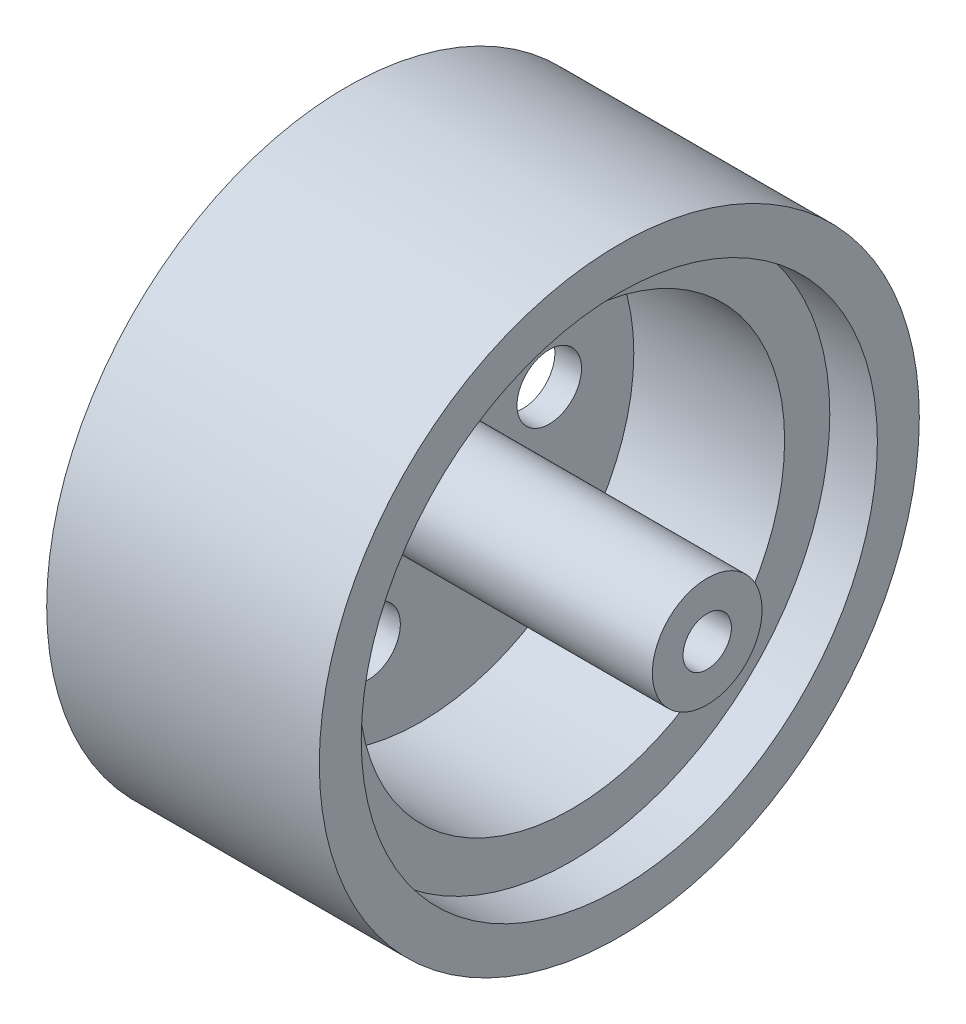
ISO-10303-21;
HEADER;
FILE_DESCRIPTION(('STEP AP214'),'2;1');
FILE_NAME('part.step','',(''),(''),'','','');
FILE_SCHEMA(('AUTOMOTIVE_DESIGN { 1 0 10303 214 1 1 1 1 }'));
ENDSEC;
DATA;
#1=APPLICATION_CONTEXT('core data for automotive mechanical design processes');
#2=APPLICATION_PROTOCOL_DEFINITION('international standard','automotive_design',2000,#1);
#3=PRODUCT_CONTEXT('',#1,'mechanical');
#4=PRODUCT('Part','Part','',(#3));
#5=PRODUCT_RELATED_PRODUCT_CATEGORY('part','',(#4));
#6=PRODUCT_DEFINITION_FORMATION('','',#4);
#7=PRODUCT_DEFINITION_CONTEXT('part definition',#1,'design');
#8=PRODUCT_DEFINITION('design','',#6,#7);
#9=PRODUCT_DEFINITION_SHAPE('','',#8);
#10=(LENGTH_UNIT() NAMED_UNIT(*) SI_UNIT(.MILLI.,.METRE.));
#11=(NAMED_UNIT(*) PLANE_ANGLE_UNIT() SI_UNIT($,.RADIAN.));
#12=(NAMED_UNIT(*) SI_UNIT($,.STERADIAN.) SOLID_ANGLE_UNIT());
#13=UNCERTAINTY_MEASURE_WITH_UNIT(LENGTH_MEASURE(1.E-05),#10,'distance_accuracy_value','');
#14=(GEOMETRIC_REPRESENTATION_CONTEXT(3) GLOBAL_UNCERTAINTY_ASSIGNED_CONTEXT((#13)) GLOBAL_UNIT_ASSIGNED_CONTEXT((#10,
#11,#12)) REPRESENTATION_CONTEXT('',''));
#15=CARTESIAN_POINT('',(0.,0.,0.));
#16=DIRECTION('',(0.,0.,1.));
#17=DIRECTION('',(1.,0.,0.));
#18=AXIS2_PLACEMENT_3D('',#15,#16,#17);
#19=CARTESIAN_POINT('',(11.,0.,0.));
#20=DIRECTION('',(1.,0.,0.));
#21=DIRECTION('',(0.,0.,-1.));
#22=AXIS2_PLACEMENT_3D('',#19,#20,#21);
#23=PLANE('',#22);
#24=CARTESIAN_POINT('',(11.,0.,0.));
#25=DIRECTION('',(1.,0.,0.));
#26=DIRECTION('',(0.,0.,-1.));
#27=AXIS2_PLACEMENT_3D('',#24,#25,#26);
#28=CIRCLE('',#27,13.2);
#29=CARTESIAN_POINT('',(11.,0.,-13.2));
#30=VERTEX_POINT('',#29);
#31=EDGE_CURVE('E44',#30,#30,#28,.T.);
#32=ORIENTED_EDGE('',*,*,#31,.F.);
#33=EDGE_LOOP('',(#32));
#34=FACE_BOUND('',#33,.T.);
#35=CARTESIAN_POINT('',(11.,0.,0.));
#36=DIRECTION('',(1.,0.,0.));
#37=DIRECTION('',(0.,0.,-1.));
#38=AXIS2_PLACEMENT_3D('',#35,#36,#37);
#39=CIRCLE('',#38,16.);
#40=CARTESIAN_POINT('',(11.,0.,-16.));
#41=VERTEX_POINT('',#40);
#42=EDGE_CURVE('E127',#41,#41,#39,.F.);
#43=ORIENTED_EDGE('',*,*,#42,.F.);
#44=EDGE_LOOP('',(#43));
#45=FACE_BOUND('',#44,.T.);
#46=ADVANCED_FACE('F31',(#34,#45),#23,.T.);
#47=CARTESIAN_POINT('',(0.,0.,0.));
#48=DIRECTION('',(1.,0.,0.));
#49=DIRECTION('',(0.,0.,-1.));
#50=AXIS2_PLACEMENT_3D('',#47,#48,#49);
#51=PLANE('',#50);
#52=CARTESIAN_POINT('',(0.,0.,0.));
#53=DIRECTION('',(1.,0.,0.));
#54=DIRECTION('',(0.,0.,-1.));
#55=AXIS2_PLACEMENT_3D('',#52,#53,#54);
#56=CIRCLE('',#55,1.5);
#57=CARTESIAN_POINT('',(0.,0.,-1.5));
#58=VERTEX_POINT('',#57);
#59=EDGE_CURVE('E89',#58,#58,#56,.T.);
#60=ORIENTED_EDGE('',*,*,#59,.T.);
#61=EDGE_LOOP('',(#60));
#62=FACE_BOUND('',#61,.T.);
#63=CARTESIAN_POINT('',(0.,-7.29999835677502,3.27261729982013));
#64=DIRECTION('',(-1.,0.,0.));
#65=DIRECTION('',(0.,-0.866025403784436,-0.500000000000004));
#66=AXIS2_PLACEMENT_3D('',#63,#64,#65);
#67=CIRCLE('',#66,2.);
#68=CARTESIAN_POINT('',(0.,-9.0320491643439,2.27261729982012));
#69=VERTEX_POINT('',#68);
#70=EDGE_CURVE('E53',#69,#69,#67,.T.);
#71=ORIENTED_EDGE('',*,*,#70,.F.);
#72=EDGE_LOOP('',(#71));
#73=FACE_BOUND('',#72,.T.);
#74=CARTESIAN_POINT('',(0.,0.815829459878878,-7.95829267446189));
#75=DIRECTION('',(-1.,0.,0.));
#76=DIRECTION('',(0.,0.866025403784443,-0.499999999999992));
#77=AXIS2_PLACEMENT_3D('',#74,#75,#76);
#78=CIRCLE('',#77,2.);
#79=CARTESIAN_POINT('',(0.,2.54788026744776,-8.95829267446187));
#80=VERTEX_POINT('',#79);
#81=EDGE_CURVE('E58',#80,#80,#78,.T.);
#82=ORIENTED_EDGE('',*,*,#81,.F.);
#83=EDGE_LOOP('',(#82));
#84=FACE_BOUND('',#83,.T.);
#85=CARTESIAN_POINT('',(0.,6.4841688968962,4.68567537464173));
#86=DIRECTION('',(-1.,0.,0.));
#87=DIRECTION('',(0.,0.,1.));
#88=AXIS2_PLACEMENT_3D('',#85,#86,#87);
#89=CIRCLE('',#88,2.);
#90=CARTESIAN_POINT('',(0.,6.4841688968962,6.68567537464173));
#91=VERTEX_POINT('',#90);
#92=EDGE_CURVE('E50',#91,#91,#89,.T.);
#93=ORIENTED_EDGE('',*,*,#92,.F.);
#94=EDGE_LOOP('',(#93));
#95=FACE_BOUND('',#94,.T.);
#96=CARTESIAN_POINT('',(0.,0.,0.));
#97=DIRECTION('',(1.,0.,0.));
#98=DIRECTION('',(0.,0.,-1.));
#99=AXIS2_PLACEMENT_3D('',#96,#97,#98);
#100=CIRCLE('',#99,16.);
#101=CARTESIAN_POINT('',(0.,0.,-16.));
#102=VERTEX_POINT('',#101);
#103=EDGE_CURVE('E10',#102,#102,#100,.T.);
#104=ORIENTED_EDGE('',*,*,#103,.F.);
#105=EDGE_LOOP('',(#104));
#106=FACE_BOUND('',#105,.T.);
#107=ADVANCED_FACE('F33',(#62,#73,#84,#95,#106),#51,.F.);
#108=CARTESIAN_POINT('',(1.65,0.,0.));
#109=DIRECTION('',(1.,0.,0.));
#110=DIRECTION('',(0.,0.,-1.));
#111=AXIS2_PLACEMENT_3D('',#108,#109,#110);
#112=CYLINDRICAL_SURFACE('',#111,13.2);
#113=CARTESIAN_POINT('',(1.65,0.,0.));
#114=DIRECTION('',(1.,0.,0.));
#115=DIRECTION('',(0.,0.,-1.));
#116=AXIS2_PLACEMENT_3D('',#113,#114,#115);
#117=CIRCLE('',#116,13.2);
#118=CARTESIAN_POINT('',(1.65,0.,-13.2));
#119=VERTEX_POINT('',#118);
#120=EDGE_CURVE('E39',#119,#119,#117,.T.);
#121=ORIENTED_EDGE('',*,*,#120,.F.);
#122=EDGE_LOOP('',(#121));
#123=FACE_BOUND('',#122,.T.);
#124=ORIENTED_EDGE('',*,*,#31,.T.);
#125=EDGE_LOOP('',(#124));
#126=FACE_BOUND('',#125,.T.);
#127=ADVANCED_FACE('F76',(#123,#126),#112,.F.);
#128=CARTESIAN_POINT('',(1.65,0.,0.));
#129=DIRECTION('',(1.,0.,0.));
#130=DIRECTION('',(0.,0.,-1.));
#131=AXIS2_PLACEMENT_3D('',#128,#129,#130);
#132=PLANE('',#131);
#133=CARTESIAN_POINT('',(1.65,0.,0.));
#134=DIRECTION('',(1.,0.,0.));
#135=DIRECTION('',(0.,0.,-1.));
#136=AXIS2_PLACEMENT_3D('',#133,#134,#135);
#137=CIRCLE('',#136,3.4);
#138=CARTESIAN_POINT('',(1.65,0.,-3.4));
#139=VERTEX_POINT('',#138);
#140=EDGE_CURVE('E66',#139,#139,#137,.T.);
#141=ORIENTED_EDGE('',*,*,#140,.F.);
#142=EDGE_LOOP('',(#141));
#143=FACE_BOUND('',#142,.T.);
#144=CARTESIAN_POINT('',(1.65,-7.29999835677502,3.27261729982013));
#145=DIRECTION('',(1.,0.,0.));
#146=DIRECTION('',(0.,0.,-1.));
#147=AXIS2_PLACEMENT_3D('',#144,#145,#146);
#148=CIRCLE('',#147,2.);
#149=CARTESIAN_POINT('',(1.65,-7.29999835677502,1.27261729982013));
#150=VERTEX_POINT('',#149);
#151=EDGE_CURVE('E35',#150,#150,#148,.T.);
#152=ORIENTED_EDGE('',*,*,#151,.F.);
#153=EDGE_LOOP('',(#152));
#154=FACE_BOUND('',#153,.T.);
#155=CARTESIAN_POINT('',(1.65,0.815829459878878,-7.95829267446189));
#156=DIRECTION('',(1.,0.,0.));
#157=DIRECTION('',(0.,0.,-1.));
#158=AXIS2_PLACEMENT_3D('',#155,#156,#157);
#159=CIRCLE('',#158,2.);
#160=CARTESIAN_POINT('',(1.65,0.815829459878878,-9.95829267446189));
#161=VERTEX_POINT('',#160);
#162=EDGE_CURVE('E51',#161,#161,#159,.T.);
#163=ORIENTED_EDGE('',*,*,#162,.F.);
#164=EDGE_LOOP('',(#163));
#165=FACE_BOUND('',#164,.T.);
#166=CARTESIAN_POINT('',(1.65,6.4841688968962,4.68567537464173));
#167=DIRECTION('',(1.,0.,0.));
#168=DIRECTION('',(0.,0.,-1.));
#169=AXIS2_PLACEMENT_3D('',#166,#167,#168);
#170=CIRCLE('',#169,2.);
#171=CARTESIAN_POINT('',(1.65,6.4841688968962,2.68567537464173));
#172=VERTEX_POINT('',#171);
#173=EDGE_CURVE('E48',#172,#172,#170,.T.);
#174=ORIENTED_EDGE('',*,*,#173,.F.);
#175=EDGE_LOOP('',(#174));
#176=FACE_BOUND('',#175,.T.);
#177=ORIENTED_EDGE('',*,*,#120,.T.);
#178=EDGE_LOOP('',(#177));
#179=FACE_BOUND('',#178,.T.);
#180=ADVANCED_FACE('F82',(#143,#154,#165,#176,#179),#132,.T.);
#181=CARTESIAN_POINT('',(9.35,6.4841688968962,4.68567537464173));
#182=DIRECTION('',(-1.,0.,0.));
#183=DIRECTION('',(0.,0.,1.));
#184=AXIS2_PLACEMENT_3D('',#181,#182,#183);
#185=CYLINDRICAL_SURFACE('',#184,2.);
#186=ORIENTED_EDGE('',*,*,#173,.T.);
#187=EDGE_LOOP('',(#186));
#188=FACE_BOUND('',#187,.T.);
#189=ORIENTED_EDGE('',*,*,#92,.T.);
#190=EDGE_LOOP('',(#189));
#191=FACE_BOUND('',#190,.T.);
#192=ADVANCED_FACE('F72',(#188,#191),#185,.F.);
#193=CARTESIAN_POINT('',(9.35,0.815829459878878,-7.95829267446189));
#194=DIRECTION('',(-1.,0.,0.));
#195=DIRECTION('',(0.,0.,1.));
#196=AXIS2_PLACEMENT_3D('',#193,#194,#195);
#197=CYLINDRICAL_SURFACE('',#196,2.);
#198=ORIENTED_EDGE('',*,*,#162,.T.);
#199=EDGE_LOOP('',(#198));
#200=FACE_BOUND('',#199,.T.);
#201=ORIENTED_EDGE('',*,*,#81,.T.);
#202=EDGE_LOOP('',(#201));
#203=FACE_BOUND('',#202,.T.);
#204=ADVANCED_FACE('F93',(#200,#203),#197,.F.);
#205=CARTESIAN_POINT('',(9.35,-7.29999835677502,3.27261729982013));
#206=DIRECTION('',(-1.,0.,0.));
#207=DIRECTION('',(0.,0.,1.));
#208=AXIS2_PLACEMENT_3D('',#205,#206,#207);
#209=CYLINDRICAL_SURFACE('',#208,2.);
#210=ORIENTED_EDGE('',*,*,#151,.T.);
#211=EDGE_LOOP('',(#210));
#212=FACE_BOUND('',#211,.T.);
#213=ORIENTED_EDGE('',*,*,#70,.T.);
#214=EDGE_LOOP('',(#213));
#215=FACE_BOUND('',#214,.T.);
#216=ADVANCED_FACE('F95',(#212,#215),#209,.F.);
#217=CARTESIAN_POINT('',(19.4,0.,0.));
#218=DIRECTION('',(-1.,0.,0.));
#219=DIRECTION('',(0.,0.,1.));
#220=AXIS2_PLACEMENT_3D('',#217,#218,#219);
#221=CYLINDRICAL_SURFACE('',#220,3.4);
#222=CARTESIAN_POINT('',(19.4,0.,0.));
#223=DIRECTION('',(1.,0.,0.));
#224=DIRECTION('',(0.,0.,-1.));
#225=AXIS2_PLACEMENT_3D('',#222,#223,#224);
#226=CIRCLE('',#225,3.4);
#227=CARTESIAN_POINT('',(19.4,0.,-3.4));
#228=VERTEX_POINT('',#227);
#229=EDGE_CURVE('E63',#228,#228,#226,.T.);
#230=ORIENTED_EDGE('',*,*,#229,.F.);
#231=EDGE_LOOP('',(#230));
#232=FACE_BOUND('',#231,.T.);
#233=ORIENTED_EDGE('',*,*,#140,.T.);
#234=EDGE_LOOP('',(#233));
#235=FACE_BOUND('',#234,.T.);
#236=ADVANCED_FACE('F101',(#232,#235),#221,.T.);
#237=CARTESIAN_POINT('',(19.4,0.,0.));
#238=DIRECTION('',(1.,0.,0.));
#239=DIRECTION('',(0.,0.,-1.));
#240=AXIS2_PLACEMENT_3D('',#237,#238,#239);
#241=PLANE('',#240);
#242=CARTESIAN_POINT('',(19.4,0.,0.));
#243=DIRECTION('',(1.,0.,0.));
#244=DIRECTION('',(0.,0.,-1.));
#245=AXIS2_PLACEMENT_3D('',#242,#243,#244);
#246=CIRCLE('',#245,1.5);
#247=CARTESIAN_POINT('',(19.4,0.,-1.5));
#248=VERTEX_POINT('',#247);
#249=EDGE_CURVE('E129',#248,#248,#246,.T.);
#250=ORIENTED_EDGE('',*,*,#249,.F.);
#251=EDGE_LOOP('',(#250));
#252=FACE_BOUND('',#251,.T.);
#253=ORIENTED_EDGE('',*,*,#229,.T.);
#254=EDGE_LOOP('',(#253));
#255=FACE_BOUND('',#254,.T.);
#256=ADVANCED_FACE('F144',(#252,#255),#241,.T.);
#257=CARTESIAN_POINT('',(-6.35,0.,0.));
#258=DIRECTION('',(1.,0.,0.));
#259=DIRECTION('',(0.,0.,-1.));
#260=AXIS2_PLACEMENT_3D('',#257,#258,#259);
#261=CYLINDRICAL_SURFACE('',#260,1.5);
#262=ORIENTED_EDGE('',*,*,#249,.T.);
#263=EDGE_LOOP('',(#262));
#264=FACE_BOUND('',#263,.T.);
#265=ORIENTED_EDGE('',*,*,#59,.F.);
#266=EDGE_LOOP('',(#265));
#267=FACE_BOUND('',#266,.T.);
#268=ADVANCED_FACE('F149',(#264,#267),#261,.F.);
#269=CARTESIAN_POINT('',(-2.95,0.,0.));
#270=DIRECTION('',(1.,0.,0.));
#271=DIRECTION('',(0.,0.,-1.));
#272=AXIS2_PLACEMENT_3D('',#269,#270,#271);
#273=CYLINDRICAL_SURFACE('',#272,16.);
#274=CARTESIAN_POINT('',(-2.95,0.,0.));
#275=DIRECTION('',(-1.,0.,0.));
#276=DIRECTION('',(0.,0.,1.));
#277=AXIS2_PLACEMENT_3D('',#274,#275,#276);
#278=CIRCLE('',#277,16.);
#279=CARTESIAN_POINT('',(-2.95,0.,16.));
#280=VERTEX_POINT('',#279);
#281=EDGE_CURVE('E135',#280,#280,#278,.T.);
#282=ORIENTED_EDGE('',*,*,#281,.T.);
#283=EDGE_LOOP('',(#282));
#284=FACE_BOUND('',#283,.T.);
#285=ORIENTED_EDGE('',*,*,#103,.T.);
#286=EDGE_LOOP('',(#285));
#287=FACE_BOUND('',#286,.T.);
#288=ADVANCED_FACE('F155',(#284,#287),#273,.F.);
#289=CARTESIAN_POINT('',(-2.95,0.,0.));
#290=DIRECTION('',(-1.,0.,0.));
#291=DIRECTION('',(0.,0.,1.));
#292=AXIS2_PLACEMENT_3D('',#289,#290,#291);
#293=PLANE('',#292);
#294=CARTESIAN_POINT('',(-2.95,0.,0.));
#295=DIRECTION('',(-1.,0.,0.));
#296=DIRECTION('',(0.,0.,1.));
#297=AXIS2_PLACEMENT_3D('',#294,#295,#296);
#298=CIRCLE('',#297,18.6);
#299=CARTESIAN_POINT('',(-2.95,0.,18.6));
#300=VERTEX_POINT('',#299);
#301=EDGE_CURVE('E130',#300,#300,#298,.T.);
#302=ORIENTED_EDGE('',*,*,#301,.T.);
#303=EDGE_LOOP('',(#302));
#304=FACE_BOUND('',#303,.T.);
#305=ORIENTED_EDGE('',*,*,#281,.F.);
#306=EDGE_LOOP('',(#305));
#307=FACE_BOUND('',#306,.T.);
#308=ADVANCED_FACE('F161',(#304,#307),#293,.T.);
#309=CARTESIAN_POINT('',(-2.95,0.,0.));
#310=DIRECTION('',(1.,0.,0.));
#311=DIRECTION('',(0.,0.,-1.));
#312=AXIS2_PLACEMENT_3D('',#309,#310,#311);
#313=CYLINDRICAL_SURFACE('',#312,18.6);
#314=ORIENTED_EDGE('',*,*,#301,.F.);
#315=EDGE_LOOP('',(#314));
#316=FACE_BOUND('',#315,.T.);
#317=CARTESIAN_POINT('',(13.95,0.,0.));
#318=DIRECTION('',(-1.,0.,0.));
#319=DIRECTION('',(0.,0.,1.));
#320=AXIS2_PLACEMENT_3D('',#317,#318,#319);
#321=CIRCLE('',#320,18.6);
#322=CARTESIAN_POINT('',(13.95,0.,18.6));
#323=VERTEX_POINT('',#322);
#324=EDGE_CURVE('E179',#323,#323,#321,.T.);
#325=ORIENTED_EDGE('',*,*,#324,.T.);
#326=EDGE_LOOP('',(#325));
#327=FACE_BOUND('',#326,.T.);
#328=ADVANCED_FACE('F157',(#316,#327),#313,.T.);
#329=ORIENTED_EDGE('',*,*,#42,.T.);
#330=EDGE_LOOP('',(#329));
#331=FACE_BOUND('',#330,.T.);
#332=CARTESIAN_POINT('',(13.95,0.,0.));
#333=DIRECTION('',(-1.,0.,0.));
#334=DIRECTION('',(0.,0.,1.));
#335=AXIS2_PLACEMENT_3D('',#332,#333,#334);
#336=CIRCLE('',#335,16.);
#337=CARTESIAN_POINT('',(13.95,0.,16.));
#338=VERTEX_POINT('',#337);
#339=EDGE_CURVE('E176',#338,#338,#336,.T.);
#340=ORIENTED_EDGE('',*,*,#339,.F.);
#341=EDGE_LOOP('',(#340));
#342=FACE_BOUND('',#341,.T.);
#343=ADVANCED_FACE('F160',(#331,#342),#273,.F.);
#344=CARTESIAN_POINT('',(13.95,0.,0.));
#345=DIRECTION('',(-1.,0.,0.));
#346=DIRECTION('',(0.,0.,1.));
#347=AXIS2_PLACEMENT_3D('',#344,#345,#346);
#348=PLANE('',#347);
#349=ORIENTED_EDGE('',*,*,#339,.T.);
#350=EDGE_LOOP('',(#349));
#351=FACE_BOUND('',#350,.T.);
#352=ORIENTED_EDGE('',*,*,#324,.F.);
#353=EDGE_LOOP('',(#352));
#354=FACE_BOUND('',#353,.T.);
#355=ADVANCED_FACE('F168',(#351,#354),#348,.F.);
#356=CLOSED_SHELL('',(#46,#107,#127,#180,#192,#204,#216,#236,#256,#268,#288,#308,#328,#343,#355));
#357=MANIFOLD_SOLID_BREP('B2',#356);
#358=ADVANCED_BREP_SHAPE_REPRESENTATION('',(#18,#357),#14);
#359=SHAPE_DEFINITION_REPRESENTATION(#9,#358);
ENDSEC;
END-ISO-10303-21;
